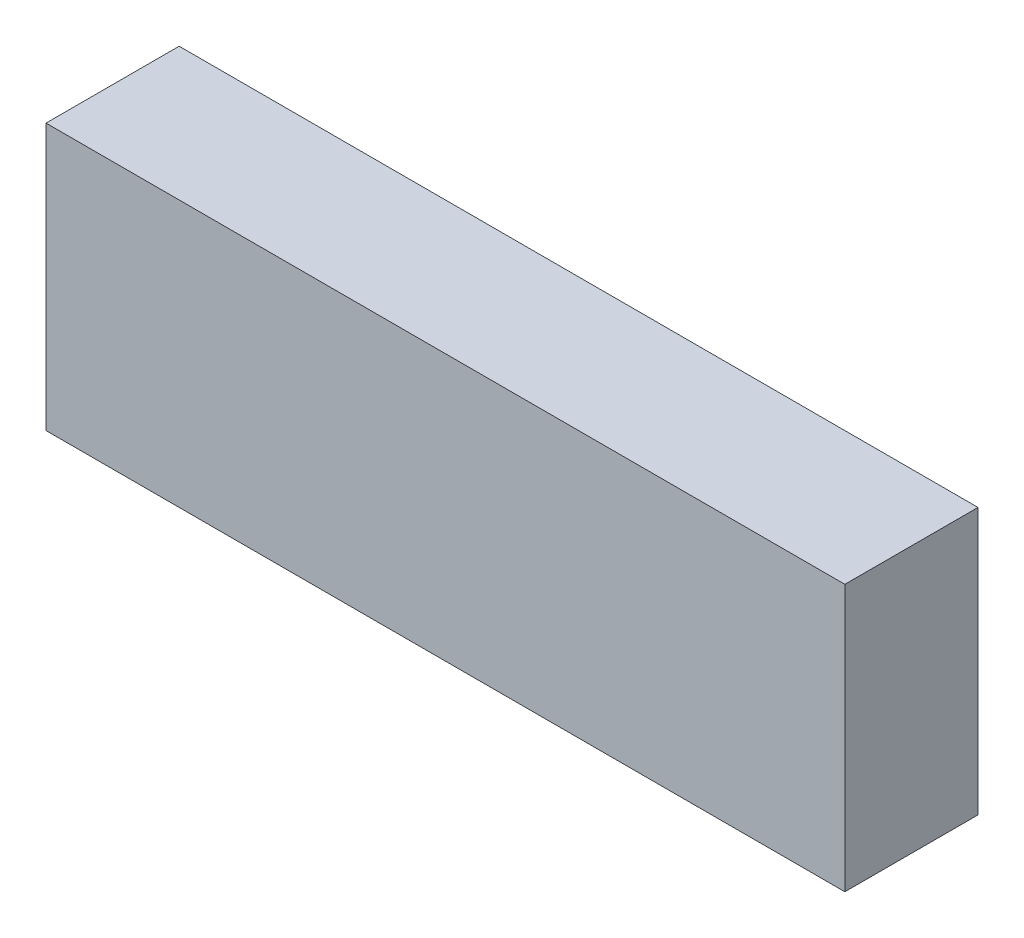
ISO-10303-21;
HEADER;
FILE_DESCRIPTION(('STEP AP214'),'2;1');
FILE_NAME('part.step','',(''),(''),'','','');
FILE_SCHEMA(('AUTOMOTIVE_DESIGN { 1 0 10303 214 1 1 1 1 }'));
ENDSEC;
DATA;
#1=APPLICATION_CONTEXT('core data for automotive mechanical design processes');
#2=APPLICATION_PROTOCOL_DEFINITION('international standard','automotive_design',2000,#1);
#3=PRODUCT_CONTEXT('',#1,'mechanical');
#4=PRODUCT('Part','Part','',(#3));
#5=PRODUCT_RELATED_PRODUCT_CATEGORY('part','',(#4));
#6=PRODUCT_DEFINITION_FORMATION('','',#4);
#7=PRODUCT_DEFINITION_CONTEXT('part definition',#1,'design');
#8=PRODUCT_DEFINITION('design','',#6,#7);
#9=PRODUCT_DEFINITION_SHAPE('','',#8);
#10=(LENGTH_UNIT() NAMED_UNIT(*) SI_UNIT(.MILLI.,.METRE.));
#11=(NAMED_UNIT(*) PLANE_ANGLE_UNIT() SI_UNIT($,.RADIAN.));
#12=(NAMED_UNIT(*) SI_UNIT($,.STERADIAN.) SOLID_ANGLE_UNIT());
#13=UNCERTAINTY_MEASURE_WITH_UNIT(LENGTH_MEASURE(1.E-05),#10,'distance_accuracy_value','');
#14=(GEOMETRIC_REPRESENTATION_CONTEXT(3) GLOBAL_UNCERTAINTY_ASSIGNED_CONTEXT((#13)) GLOBAL_UNIT_ASSIGNED_CONTEXT((#10,
#11,#12)) REPRESENTATION_CONTEXT('',''));
#15=CARTESIAN_POINT('',(0.,0.,0.));
#16=DIRECTION('',(0.,0.,1.));
#17=DIRECTION('',(1.,0.,0.));
#18=AXIS2_PLACEMENT_3D('',#15,#16,#17);
#19=CARTESIAN_POINT('',(-81.6563355501959,-33.3808398612803,2.5));
#20=DIRECTION('',(0.,1.,0.));
#21=DIRECTION('',(0.,0.,1.));
#22=AXIS2_PLACEMENT_3D('',#19,#20,#21);
#23=PLANE('',#22);
#24=DIRECTION('',(1.,0.,0.));
#25=VECTOR('',#24,1.);
#26=CARTESIAN_POINT('',(-81.6563355501959,-33.3808398612803,-2.5));
#27=LINE('',#26,#25);
#28=CARTESIAN_POINT('',(-81.6563355501959,-33.3808398612803,-2.5));
#29=VERTEX_POINT('',#28);
#30=CARTESIAN_POINT('',(-51.6563355501959,-33.3808398612803,-2.5));
#31=VERTEX_POINT('',#30);
#32=EDGE_CURVE('E106',#29,#31,#27,.T.);
#33=ORIENTED_EDGE('',*,*,#32,.T.);
#34=DIRECTION('',(0.,0.,-1.));
#35=VECTOR('',#34,1.);
#36=CARTESIAN_POINT('',(-51.6563355501959,-33.3808398612803,2.5));
#37=LINE('',#36,#35);
#38=CARTESIAN_POINT('',(-51.6563355501959,-33.3808398612803,2.5));
#39=VERTEX_POINT('',#38);
#40=EDGE_CURVE('E11',#39,#31,#37,.T.);
#41=ORIENTED_EDGE('',*,*,#40,.F.);
#42=DIRECTION('',(1.,0.,0.));
#43=VECTOR('',#42,1.);
#44=CARTESIAN_POINT('',(-81.6563355501959,-33.3808398612803,2.5));
#45=LINE('',#44,#43);
#46=CARTESIAN_POINT('',(-81.6563355501959,-33.3808398612803,2.5));
#47=VERTEX_POINT('',#46);
#48=EDGE_CURVE('E79',#47,#39,#45,.T.);
#49=ORIENTED_EDGE('',*,*,#48,.F.);
#50=DIRECTION('',(0.,0.,-1.));
#51=VECTOR('',#50,1.);
#52=CARTESIAN_POINT('',(-81.6563355501959,-33.3808398612803,2.5));
#53=LINE('',#52,#51);
#54=EDGE_CURVE('E102',#47,#29,#53,.T.);
#55=ORIENTED_EDGE('',*,*,#54,.T.);
#56=EDGE_LOOP('',(#33,#41,#49,#55));
#57=FACE_BOUND('',#56,.T.);
#58=ADVANCED_FACE('F39',(#57),#23,.F.);
#59=CARTESIAN_POINT('',(-51.6563355501959,-23.3808398612803,2.5));
#60=DIRECTION('',(1.,0.,0.));
#61=DIRECTION('',(0.,1.,0.));
#62=AXIS2_PLACEMENT_3D('',#59,#60,#61);
#63=PLANE('',#62);
#64=DIRECTION('',(0.,-1.,0.));
#65=VECTOR('',#64,1.);
#66=CARTESIAN_POINT('',(-51.6563355501959,-23.3808398612803,-2.5));
#67=LINE('',#66,#65);
#68=CARTESIAN_POINT('',(-51.6563355501959,-23.3808398612803,-2.5));
#69=VERTEX_POINT('',#68);
#70=EDGE_CURVE('E88',#69,#31,#67,.T.);
#71=ORIENTED_EDGE('',*,*,#70,.F.);
#72=DIRECTION('',(0.,0.,-1.));
#73=VECTOR('',#72,1.);
#74=CARTESIAN_POINT('',(-51.6563355501959,-23.3808398612803,2.5));
#75=LINE('',#74,#73);
#76=CARTESIAN_POINT('',(-51.6563355501959,-23.3808398612803,2.5));
#77=VERTEX_POINT('',#76);
#78=EDGE_CURVE('E48',#77,#69,#75,.T.);
#79=ORIENTED_EDGE('',*,*,#78,.F.);
#80=DIRECTION('',(0.,-1.,0.));
#81=VECTOR('',#80,1.);
#82=CARTESIAN_POINT('',(-51.6563355501959,-23.3808398612803,2.5));
#83=LINE('',#82,#81);
#84=EDGE_CURVE('E86',#77,#39,#83,.T.);
#85=ORIENTED_EDGE('',*,*,#84,.T.);
#86=ORIENTED_EDGE('',*,*,#40,.T.);
#87=EDGE_LOOP('',(#71,#79,#85,#86));
#88=FACE_BOUND('',#87,.T.);
#89=ADVANCED_FACE('F85',(#88),#63,.T.);
#90=CARTESIAN_POINT('',(-81.6563355501959,-23.3808398612803,2.5));
#91=DIRECTION('',(0.,1.,0.));
#92=DIRECTION('',(0.,0.,1.));
#93=AXIS2_PLACEMENT_3D('',#90,#91,#92);
#94=PLANE('',#93);
#95=DIRECTION('',(1.,0.,0.));
#96=VECTOR('',#95,1.);
#97=CARTESIAN_POINT('',(-81.6563355501959,-23.3808398612803,-2.5));
#98=LINE('',#97,#96);
#99=CARTESIAN_POINT('',(-81.6563355501959,-23.3808398612803,-2.5));
#100=VERTEX_POINT('',#99);
#101=EDGE_CURVE('E112',#100,#69,#98,.T.);
#102=ORIENTED_EDGE('',*,*,#101,.F.);
#103=DIRECTION('',(0.,0.,-1.));
#104=VECTOR('',#103,1.);
#105=CARTESIAN_POINT('',(-81.6563355501959,-23.3808398612803,2.5));
#106=LINE('',#105,#104);
#107=CARTESIAN_POINT('',(-81.6563355501959,-23.3808398612803,2.5));
#108=VERTEX_POINT('',#107);
#109=EDGE_CURVE('E71',#108,#100,#106,.T.);
#110=ORIENTED_EDGE('',*,*,#109,.F.);
#111=DIRECTION('',(1.,0.,0.));
#112=VECTOR('',#111,1.);
#113=CARTESIAN_POINT('',(-81.6563355501959,-23.3808398612803,2.5));
#114=LINE('',#113,#112);
#115=EDGE_CURVE('E95',#108,#77,#114,.T.);
#116=ORIENTED_EDGE('',*,*,#115,.T.);
#117=ORIENTED_EDGE('',*,*,#78,.T.);
#118=EDGE_LOOP('',(#102,#110,#116,#117));
#119=FACE_BOUND('',#118,.T.);
#120=ADVANCED_FACE('F98',(#119),#94,.T.);
#121=CARTESIAN_POINT('',(-81.6563355501959,-23.3808398612803,2.5));
#122=DIRECTION('',(1.,0.,0.));
#123=DIRECTION('',(0.,0.,-1.));
#124=AXIS2_PLACEMENT_3D('',#121,#122,#123);
#125=PLANE('',#124);
#126=DIRECTION('',(0.,-1.,0.));
#127=VECTOR('',#126,1.);
#128=CARTESIAN_POINT('',(-81.6563355501959,-23.3808398612803,-2.5));
#129=LINE('',#128,#127);
#130=EDGE_CURVE('E74',#100,#29,#129,.T.);
#131=ORIENTED_EDGE('',*,*,#130,.T.);
#132=ORIENTED_EDGE('',*,*,#54,.F.);
#133=DIRECTION('',(0.,-1.,0.));
#134=VECTOR('',#133,1.);
#135=CARTESIAN_POINT('',(-81.6563355501959,-23.3808398612803,2.5));
#136=LINE('',#135,#134);
#137=EDGE_CURVE('E56',#108,#47,#136,.T.);
#138=ORIENTED_EDGE('',*,*,#137,.F.);
#139=ORIENTED_EDGE('',*,*,#109,.T.);
#140=EDGE_LOOP('',(#131,#132,#138,#139));
#141=FACE_BOUND('',#140,.T.);
#142=ADVANCED_FACE('F129',(#141),#125,.F.);
#143=CARTESIAN_POINT('',(0.,0.,2.5));
#144=DIRECTION('',(0.,0.,-1.));
#145=DIRECTION('',(-1.,0.,0.));
#146=AXIS2_PLACEMENT_3D('',#143,#144,#145);
#147=PLANE('',#146);
#148=ORIENTED_EDGE('',*,*,#48,.T.);
#149=ORIENTED_EDGE('',*,*,#84,.F.);
#150=ORIENTED_EDGE('',*,*,#115,.F.);
#151=ORIENTED_EDGE('',*,*,#137,.T.);
#152=EDGE_LOOP('',(#148,#149,#150,#151));
#153=FACE_BOUND('',#152,.T.);
#154=ADVANCED_FACE('F94',(#153),#147,.F.);
#155=CARTESIAN_POINT('',(0.,0.,-2.5));
#156=DIRECTION('',(0.,0.,-1.));
#157=DIRECTION('',(-1.,0.,0.));
#158=AXIS2_PLACEMENT_3D('',#155,#156,#157);
#159=PLANE('',#158);
#160=ORIENTED_EDGE('',*,*,#32,.F.);
#161=ORIENTED_EDGE('',*,*,#130,.F.);
#162=ORIENTED_EDGE('',*,*,#101,.T.);
#163=ORIENTED_EDGE('',*,*,#70,.T.);
#164=EDGE_LOOP('',(#160,#161,#162,#163));
#165=FACE_BOUND('',#164,.T.);
#166=ADVANCED_FACE('F123',(#165),#159,.T.);
#167=CLOSED_SHELL('',(#58,#89,#120,#142,#154,#166));
#168=MANIFOLD_SOLID_BREP('B2',#167);
#169=ADVANCED_BREP_SHAPE_REPRESENTATION('',(#18,#168),#14);
#170=SHAPE_DEFINITION_REPRESENTATION(#9,#169);
ENDSEC;
END-ISO-10303-21;
